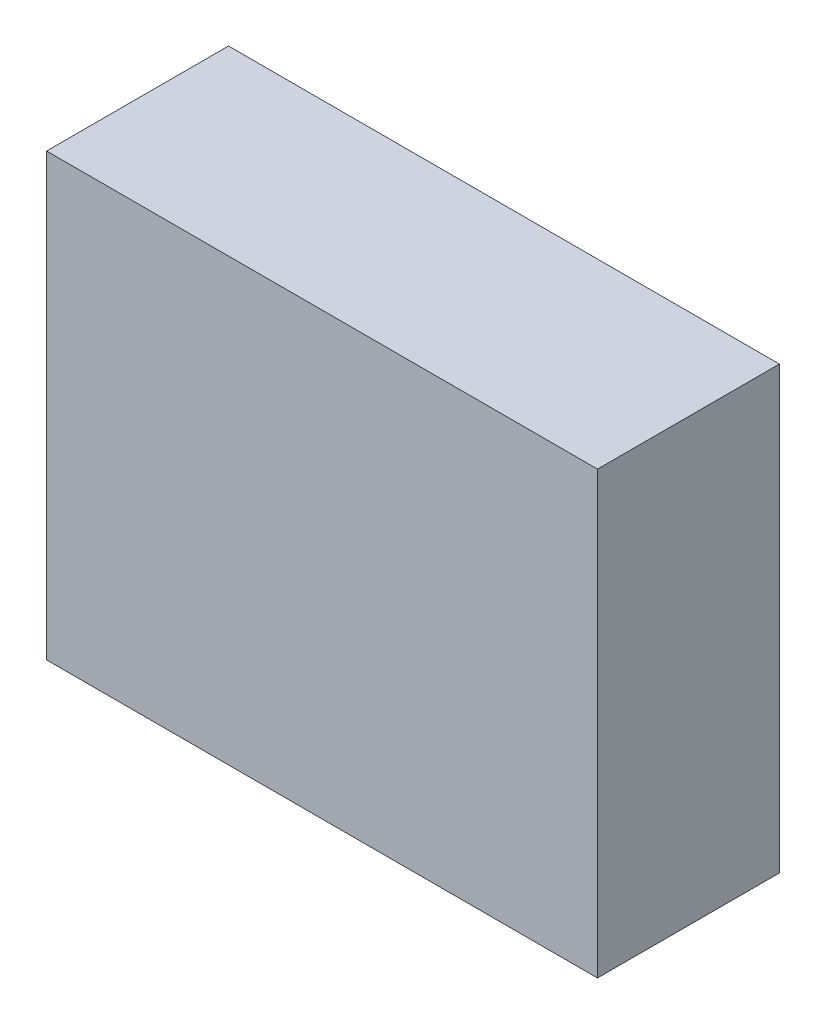
ISO-10303-21;
HEADER;
FILE_DESCRIPTION(('STEP AP214'),'2;1');
FILE_NAME('part.step','',(''),(''),'','','');
FILE_SCHEMA(('AUTOMOTIVE_DESIGN { 1 0 10303 214 1 1 1 1 }'));
ENDSEC;
DATA;
#1=APPLICATION_CONTEXT('core data for automotive mechanical design processes');
#2=APPLICATION_PROTOCOL_DEFINITION('international standard','automotive_design',2000,#1);
#3=PRODUCT_CONTEXT('',#1,'mechanical');
#4=PRODUCT('Part','Part','',(#3));
#5=PRODUCT_RELATED_PRODUCT_CATEGORY('part','',(#4));
#6=PRODUCT_DEFINITION_FORMATION('','',#4);
#7=PRODUCT_DEFINITION_CONTEXT('part definition',#1,'design');
#8=PRODUCT_DEFINITION('design','',#6,#7);
#9=PRODUCT_DEFINITION_SHAPE('','',#8);
#10=(LENGTH_UNIT() NAMED_UNIT(*) SI_UNIT(.MILLI.,.METRE.));
#11=(NAMED_UNIT(*) PLANE_ANGLE_UNIT() SI_UNIT($,.RADIAN.));
#12=(NAMED_UNIT(*) SI_UNIT($,.STERADIAN.) SOLID_ANGLE_UNIT());
#13=UNCERTAINTY_MEASURE_WITH_UNIT(LENGTH_MEASURE(1.E-05),#10,'distance_accuracy_value','');
#14=(GEOMETRIC_REPRESENTATION_CONTEXT(3) GLOBAL_UNCERTAINTY_ASSIGNED_CONTEXT((#13)) GLOBAL_UNIT_ASSIGNED_CONTEXT((#10,
#11,#12)) REPRESENTATION_CONTEXT('',''));
#15=CARTESIAN_POINT('',(0.,0.,0.));
#16=DIRECTION('',(0.,0.,1.));
#17=DIRECTION('',(1.,0.,0.));
#18=AXIS2_PLACEMENT_3D('',#15,#16,#17);
#19=CARTESIAN_POINT('',(2.50000008,2.00000108,1.651));
#20=DIRECTION('',(0.,0.,-1.));
#21=DIRECTION('',(-1.,0.,0.));
#22=AXIS2_PLACEMENT_3D('',#19,#20,#21);
#23=PLANE('',#22);
#24=DIRECTION('',(0.,1.,0.));
#25=VECTOR('',#24,1.);
#26=CARTESIAN_POINT('',(-2.50000008,2.00000108,1.651));
#27=LINE('',#26,#25);
#28=CARTESIAN_POINT('',(-2.50000008,2.00000108,1.651));
#29=VERTEX_POINT('',#28);
#30=CARTESIAN_POINT('',(-2.50000008,-1.99999854,1.651));
#31=VERTEX_POINT('',#30);
#32=EDGE_CURVE('E55',#29,#31,#27,.F.);
#33=ORIENTED_EDGE('',*,*,#32,.T.);
#34=DIRECTION('',(1.,0.,0.));
#35=VECTOR('',#34,1.);
#36=CARTESIAN_POINT('',(-2.50000008,-1.99999854,1.651));
#37=LINE('',#36,#35);
#38=CARTESIAN_POINT('',(2.50000008,-1.99999854,1.651));
#39=VERTEX_POINT('',#38);
#40=EDGE_CURVE('E57',#31,#39,#37,.T.);
#41=ORIENTED_EDGE('',*,*,#40,.T.);
#42=DIRECTION('',(0.,1.,0.));
#43=VECTOR('',#42,1.);
#44=CARTESIAN_POINT('',(2.50000008,-1.99999854,1.651));
#45=LINE('',#44,#43);
#46=CARTESIAN_POINT('',(2.50000008,2.00000108,1.651));
#47=VERTEX_POINT('',#46);
#48=EDGE_CURVE('E20',#39,#47,#45,.T.);
#49=ORIENTED_EDGE('',*,*,#48,.T.);
#50=DIRECTION('',(1.,0.,0.));
#51=VECTOR('',#50,1.);
#52=CARTESIAN_POINT('',(2.50000008,2.00000108,1.651));
#53=LINE('',#52,#51);
#54=EDGE_CURVE('E80',#47,#29,#53,.F.);
#55=ORIENTED_EDGE('',*,*,#54,.T.);
#56=EDGE_LOOP('',(#33,#41,#49,#55));
#57=FACE_BOUND('',#56,.T.);
#58=ADVANCED_FACE('F17',(#57),#23,.F.);
#59=CARTESIAN_POINT('',(2.50000008,-1.99999854,0.));
#60=DIRECTION('',(-1.,0.,0.));
#61=DIRECTION('',(0.,0.,1.));
#62=AXIS2_PLACEMENT_3D('',#59,#60,#61);
#63=PLANE('',#62);
#64=DIRECTION('',(0.,0.,-1.));
#65=VECTOR('',#64,1.);
#66=CARTESIAN_POINT('',(2.50000008,2.00000108,0.));
#67=LINE('',#66,#65);
#68=CARTESIAN_POINT('',(2.50000008,2.00000108,0.));
#69=VERTEX_POINT('',#68);
#70=EDGE_CURVE('E68',#69,#47,#67,.F.);
#71=ORIENTED_EDGE('',*,*,#70,.T.);
#72=ORIENTED_EDGE('',*,*,#48,.F.);
#73=DIRECTION('',(0.,0.,1.));
#74=VECTOR('',#73,1.);
#75=CARTESIAN_POINT('',(2.50000008,-1.99999854,0.));
#76=LINE('',#75,#74);
#77=CARTESIAN_POINT('',(2.50000008,-1.99999854,0.));
#78=VERTEX_POINT('',#77);
#79=EDGE_CURVE('E63',#39,#78,#76,.F.);
#80=ORIENTED_EDGE('',*,*,#79,.T.);
#81=DIRECTION('',(0.,1.,0.));
#82=VECTOR('',#81,1.);
#83=CARTESIAN_POINT('',(2.50000008,2.00000108,0.));
#84=LINE('',#83,#82);
#85=EDGE_CURVE('E83',#69,#78,#84,.F.);
#86=ORIENTED_EDGE('',*,*,#85,.F.);
#87=EDGE_LOOP('',(#71,#72,#80,#86));
#88=FACE_BOUND('',#87,.T.);
#89=ADVANCED_FACE('F65',(#88),#63,.F.);
#90=CARTESIAN_POINT('',(-2.50000008,-1.99999854,0.));
#91=DIRECTION('',(0.,1.,0.));
#92=DIRECTION('',(0.,0.,1.));
#93=AXIS2_PLACEMENT_3D('',#90,#91,#92);
#94=PLANE('',#93);
#95=ORIENTED_EDGE('',*,*,#79,.F.);
#96=ORIENTED_EDGE('',*,*,#40,.F.);
#97=DIRECTION('',(0.,0.,-1.));
#98=VECTOR('',#97,1.);
#99=CARTESIAN_POINT('',(-2.50000008,-1.99999854,0.));
#100=LINE('',#99,#98);
#101=CARTESIAN_POINT('',(-2.50000008,-1.99999854,0.));
#102=VERTEX_POINT('',#101);
#103=EDGE_CURVE('E75',#31,#102,#100,.T.);
#104=ORIENTED_EDGE('',*,*,#103,.T.);
#105=DIRECTION('',(-1.,0.,0.));
#106=VECTOR('',#105,1.);
#107=CARTESIAN_POINT('',(2.50000008,-1.99999854,0.));
#108=LINE('',#107,#106);
#109=EDGE_CURVE('E72',#78,#102,#108,.T.);
#110=ORIENTED_EDGE('',*,*,#109,.F.);
#111=EDGE_LOOP('',(#95,#96,#104,#110));
#112=FACE_BOUND('',#111,.T.);
#113=ADVANCED_FACE('F70',(#112),#94,.F.);
#114=CARTESIAN_POINT('',(-2.50000008,2.00000108,0.));
#115=DIRECTION('',(1.,0.,0.));
#116=DIRECTION('',(0.,0.,-1.));
#117=AXIS2_PLACEMENT_3D('',#114,#115,#116);
#118=PLANE('',#117);
#119=ORIENTED_EDGE('',*,*,#103,.F.);
#120=ORIENTED_EDGE('',*,*,#32,.F.);
#121=DIRECTION('',(0.,0.,-1.));
#122=VECTOR('',#121,1.);
#123=CARTESIAN_POINT('',(-2.50000008,2.00000108,0.));
#124=LINE('',#123,#122);
#125=CARTESIAN_POINT('',(-2.50000008,2.00000108,0.));
#126=VERTEX_POINT('',#125);
#127=EDGE_CURVE('E35',#29,#126,#124,.T.);
#128=ORIENTED_EDGE('',*,*,#127,.T.);
#129=DIRECTION('',(0.,1.,0.));
#130=VECTOR('',#129,1.);
#131=CARTESIAN_POINT('',(-2.50000008,2.00000108,0.));
#132=LINE('',#131,#130);
#133=EDGE_CURVE('E26',#102,#126,#132,.T.);
#134=ORIENTED_EDGE('',*,*,#133,.F.);
#135=EDGE_LOOP('',(#119,#120,#128,#134));
#136=FACE_BOUND('',#135,.T.);
#137=ADVANCED_FACE('F89',(#136),#118,.F.);
#138=CARTESIAN_POINT('',(2.50000008,2.00000108,0.));
#139=DIRECTION('',(0.,-1.,0.));
#140=DIRECTION('',(0.,0.,-1.));
#141=AXIS2_PLACEMENT_3D('',#138,#139,#140);
#142=PLANE('',#141);
#143=ORIENTED_EDGE('',*,*,#127,.F.);
#144=ORIENTED_EDGE('',*,*,#54,.F.);
#145=ORIENTED_EDGE('',*,*,#70,.F.);
#146=DIRECTION('',(-1.,0.,0.));
#147=VECTOR('',#146,1.);
#148=CARTESIAN_POINT('',(2.50000008,2.00000108,0.));
#149=LINE('',#148,#147);
#150=EDGE_CURVE('E11',#126,#69,#149,.F.);
#151=ORIENTED_EDGE('',*,*,#150,.F.);
#152=EDGE_LOOP('',(#143,#144,#145,#151));
#153=FACE_BOUND('',#152,.T.);
#154=ADVANCED_FACE('F91',(#153),#142,.F.);
#155=CARTESIAN_POINT('',(2.50000008,2.00000108,0.));
#156=DIRECTION('',(0.,0.,-1.));
#157=DIRECTION('',(-1.,0.,0.));
#158=AXIS2_PLACEMENT_3D('',#155,#156,#157);
#159=PLANE('',#158);
#160=ORIENTED_EDGE('',*,*,#133,.T.);
#161=ORIENTED_EDGE('',*,*,#150,.T.);
#162=ORIENTED_EDGE('',*,*,#85,.T.);
#163=ORIENTED_EDGE('',*,*,#109,.T.);
#164=EDGE_LOOP('',(#160,#161,#162,#163));
#165=FACE_BOUND('',#164,.T.);
#166=ADVANCED_FACE('F88',(#165),#159,.T.);
#167=CLOSED_SHELL('',(#58,#89,#113,#137,#154,#166));
#168=MANIFOLD_SOLID_BREP('B1',#167);
#169=ADVANCED_BREP_SHAPE_REPRESENTATION('',(#18,#168),#14);
#170=SHAPE_DEFINITION_REPRESENTATION(#9,#169);
ENDSEC;
END-ISO-10303-21;
